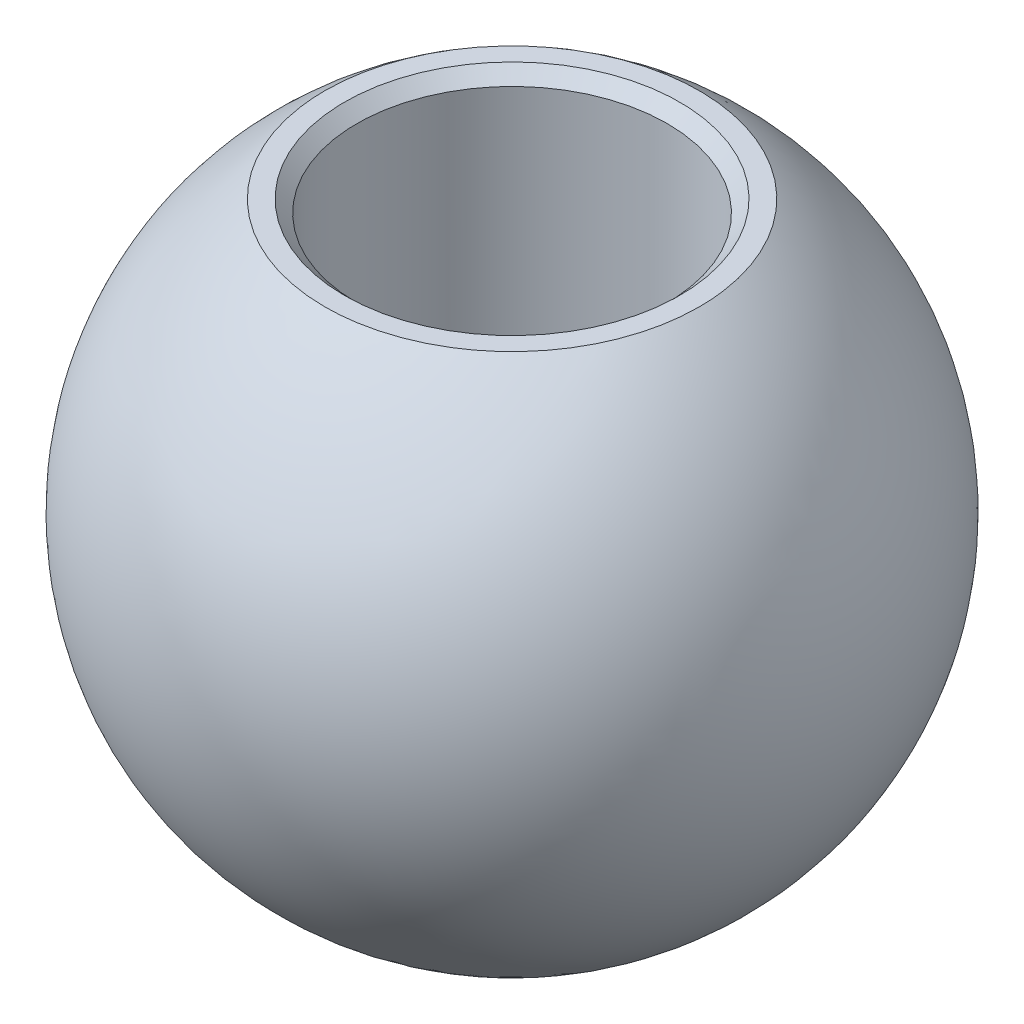
ISO-10303-21;
HEADER;
FILE_DESCRIPTION(('STEP AP214'),'2;1');
FILE_NAME('part.step','',(''),(''),'','','');
FILE_SCHEMA(('AUTOMOTIVE_DESIGN { 1 0 10303 214 1 1 1 1 }'));
ENDSEC;
DATA;
#1=APPLICATION_CONTEXT('core data for automotive mechanical design processes');
#2=APPLICATION_PROTOCOL_DEFINITION('international standard','automotive_design',2000,#1);
#3=PRODUCT_CONTEXT('',#1,'mechanical');
#4=PRODUCT('Part','Part','',(#3));
#5=PRODUCT_RELATED_PRODUCT_CATEGORY('part','',(#4));
#6=PRODUCT_DEFINITION_FORMATION('','',#4);
#7=PRODUCT_DEFINITION_CONTEXT('part definition',#1,'design');
#8=PRODUCT_DEFINITION('design','',#6,#7);
#9=PRODUCT_DEFINITION_SHAPE('','',#8);
#10=(LENGTH_UNIT() NAMED_UNIT(*) SI_UNIT(.MILLI.,.METRE.));
#11=(NAMED_UNIT(*) PLANE_ANGLE_UNIT() SI_UNIT($,.RADIAN.));
#12=(NAMED_UNIT(*) SI_UNIT($,.STERADIAN.) SOLID_ANGLE_UNIT());
#13=UNCERTAINTY_MEASURE_WITH_UNIT(LENGTH_MEASURE(1.E-05),#10,'distance_accuracy_value','');
#14=(GEOMETRIC_REPRESENTATION_CONTEXT(3) GLOBAL_UNCERTAINTY_ASSIGNED_CONTEXT((#13)) GLOBAL_UNIT_ASSIGNED_CONTEXT((#10,
#11,#12)) REPRESENTATION_CONTEXT('',''));
#15=CARTESIAN_POINT('',(0.,0.,0.));
#16=DIRECTION('',(0.,0.,1.));
#17=DIRECTION('',(1.,0.,0.));
#18=AXIS2_PLACEMENT_3D('',#15,#16,#17);
#19=CARTESIAN_POINT('',(0.,0.,39.6748));
#20=DIRECTION('',(0.,1.,0.));
#21=DIRECTION('',(0.,0.,1.));
#22=AXIS2_PLACEMENT_3D('',#19,#20,#21);
#23=CYLINDRICAL_SURFACE('',#22,3.175);
#24=CARTESIAN_POINT('',(0.,-5.29590000002145,39.6748));
#25=DIRECTION('',(0.,-1.,0.));
#26=DIRECTION('',(0.,0.,-1.));
#27=AXIS2_PLACEMENT_3D('',#24,#25,#26);
#28=CIRCLE('',#27,3.17499999999858);
#29=CARTESIAN_POINT('',(0.,-5.29590000002145,36.4998000000014));
#30=VERTEX_POINT('',#29);
#31=EDGE_CURVE('E56',#30,#30,#28,.T.);
#32=ORIENTED_EDGE('',*,*,#31,.T.);
#33=EDGE_LOOP('',(#32));
#34=FACE_BOUND('',#33,.T.);
#35=CARTESIAN_POINT('',(0.,5.29590000002145,39.6748));
#36=DIRECTION('',(0.,1.,0.));
#37=DIRECTION('',(0.,0.,-1.));
#38=AXIS2_PLACEMENT_3D('',#35,#36,#37);
#39=CIRCLE('',#38,3.17499999999858);
#40=CARTESIAN_POINT('',(0.,5.29590000002145,36.4998000000014));
#41=VERTEX_POINT('',#40);
#42=EDGE_CURVE('E53',#41,#41,#39,.T.);
#43=ORIENTED_EDGE('',*,*,#42,.T.);
#44=EDGE_LOOP('',(#43));
#45=FACE_BOUND('',#44,.T.);
#46=ADVANCED_FACE('F16',(#34,#45),#23,.F.);
#47=CARTESIAN_POINT('',(0.,-5.54990000000544,39.6748));
#48=DIRECTION('',(0.,-1.,0.));
#49=DIRECTION('',(1.,0.,0.));
#50=AXIS2_PLACEMENT_3D('',#47,#48,#49);
#51=CONICAL_SURFACE('',#50,3.42899999998257,0.785398163397448);
#52=ORIENTED_EDGE('',*,*,#31,.F.);
#53=EDGE_LOOP('',(#52));
#54=FACE_BOUND('',#53,.T.);
#55=CARTESIAN_POINT('',(0.,-5.54990000000544,39.6748));
#56=DIRECTION('',(0.,-1.,0.));
#57=DIRECTION('',(1.,0.,0.));
#58=AXIS2_PLACEMENT_3D('',#55,#56,#57);
#59=CIRCLE('',#58,3.42899999998257);
#60=CARTESIAN_POINT('',(3.42899999998257,-5.54990000000544,39.6748));
#61=VERTEX_POINT('',#60);
#62=EDGE_CURVE('E19',#61,#61,#59,.T.);
#63=ORIENTED_EDGE('',*,*,#62,.T.);
#64=EDGE_LOOP('',(#63));
#65=FACE_BOUND('',#64,.T.);
#66=ADVANCED_FACE('F72',(#54,#65),#51,.F.);
#67=CARTESIAN_POINT('',(0.,5.54990000000544,39.6748));
#68=DIRECTION('',(0.,1.,0.));
#69=DIRECTION('',(0.,0.,1.));
#70=AXIS2_PLACEMENT_3D('',#67,#68,#69);
#71=CONICAL_SURFACE('',#70,3.42899999998257,0.785398163397448);
#72=ORIENTED_EDGE('',*,*,#42,.F.);
#73=EDGE_LOOP('',(#72));
#74=FACE_BOUND('',#73,.T.);
#75=CARTESIAN_POINT('',(0.,5.54990000000544,39.6748));
#76=DIRECTION('',(0.,1.,0.));
#77=DIRECTION('',(0.,0.,1.));
#78=AXIS2_PLACEMENT_3D('',#75,#76,#77);
#79=CIRCLE('',#78,3.42899999998257);
#80=CARTESIAN_POINT('',(0.,5.54990000000544,43.1037999999826));
#81=VERTEX_POINT('',#80);
#82=EDGE_CURVE('E65',#81,#81,#79,.T.);
#83=ORIENTED_EDGE('',*,*,#82,.T.);
#84=EDGE_LOOP('',(#83));
#85=FACE_BOUND('',#84,.T.);
#86=ADVANCED_FACE('F69',(#74,#85),#71,.F.);
#87=CARTESIAN_POINT('',(0.,-5.5499,39.6748));
#88=DIRECTION('',(0.,1.,0.));
#89=DIRECTION('',(-1.,0.,0.));
#90=AXIS2_PLACEMENT_3D('',#87,#88,#89);
#91=PLANE('',#90);
#92=CARTESIAN_POINT('',(0.,-5.5499,35.8438602092959));
#93=CARTESIAN_POINT('',(-0.107560775489727,-5.5499,35.8438608538725));
#94=CARTESIAN_POINT('',(-0.215141318177451,-5.5499,35.848394213229));
#95=CARTESIAN_POINT('',(-0.429558956188675,-5.5499,35.8664981774296));
#96=CARTESIAN_POINT('',(-0.536395822611043,-5.5499,35.8800714503515));
#97=CARTESIAN_POINT('',(-0.748726176787743,-5.5499,35.9161941750471));
#98=CARTESIAN_POINT('',(-0.85421725643116,-5.5499,35.938757875481));
#99=CARTESIAN_POINT('',(-1.06298226396203,-5.5499,35.9927059197735));
#100=CARTESIAN_POINT('',(-1.16625431910558,-5.5499,36.0240974216413));
#101=CARTESIAN_POINT('',(-1.47119352235872,-5.5499,36.1310796247804));
#102=CARTESIAN_POINT('',(-1.66849689521164,-5.5499,36.2195658970729));
#103=CARTESIAN_POINT('',(-2.04542564653015,-5.5499,36.4284538360004));
#104=CARTESIAN_POINT('',(-2.2250503526241,-5.5499,36.5488567158751));
#105=CARTESIAN_POINT('',(-2.47732579567173,-5.5499,36.7506573832832));
#106=CARTESIAN_POINT('',(-2.55860486336777,-5.5499,36.8215102760885));
#107=CARTESIAN_POINT('',(-2.71484927091412,-5.5499,36.9697554186121));
#108=CARTESIAN_POINT('',(-2.7898206225931,-5.5499,37.0471412975415));
#109=CARTESIAN_POINT('',(-2.93301042319193,-5.5499,37.2079907672465));
#110=CARTESIAN_POINT('',(-3.00122579771925,-5.5499,37.2914570952949));
#111=CARTESIAN_POINT('',(-3.13038953090659,-5.5499,37.4638320543184));
#112=CARTESIAN_POINT('',(-3.1913362027842,-5.5499,37.552741941315));
#113=CARTESIAN_POINT('',(-3.36255226726154,-5.5499,37.8266674734093));
#114=CARTESIAN_POINT('',(-3.4613487532267,-5.5499,38.0190489765092));
#115=CARTESIAN_POINT('',(-3.62518118970368,-5.5499,38.4175642252858));
#116=CARTESIAN_POINT('',(-3.69021750078995,-5.5499,38.6236978240571));
#117=CARTESIAN_POINT('',(-3.7847775931866,-5.5499,39.0439845011588));
#118=CARTESIAN_POINT('',(-3.81430118484399,-5.5499,39.2581376223106));
#119=CARTESIAN_POINT('',(-3.83696718467793,-5.5499,39.6883605821669));
#120=CARTESIAN_POINT('',(-3.83010959285449,-5.5499,39.9044304208714));
#121=CARTESIAN_POINT('',(-3.7802354247317,-5.5499,40.332326517345));
#122=CARTESIAN_POINT('',(-3.73721904153498,-5.5499,40.5441527977703));
#123=CARTESIAN_POINT('',(-3.61616833900696,-5.5499,40.9576769181876));
#124=CARTESIAN_POINT('',(-3.53813364566095,-5.5499,41.1593746499757));
#125=CARTESIAN_POINT('',(-3.39664868094415,-5.5499,41.449774620064));
#126=CARTESIAN_POINT('',(-3.34538178526097,-5.5499,41.5445964014526));
#127=CARTESIAN_POINT('',(-3.23504572803441,-5.5499,41.7295892417058));
#128=CARTESIAN_POINT('',(-3.17597837591451,-5.5499,41.8197613723967));
#129=CARTESIAN_POINT('',(-3.05048283485182,-5.5499,41.994766343964));
#130=CARTESIAN_POINT('',(-2.98405799090635,-5.5499,42.0796015839123));
#131=CARTESIAN_POINT('',(-2.84425568754826,-5.5499,42.2434437431605));
#132=CARTESIAN_POINT('',(-2.77087158016473,-5.5499,42.3224449586444));
#133=CARTESIAN_POINT('',(-2.54119731222613,-5.5499,42.5496368140841));
#134=CARTESIAN_POINT('',(-2.3752185610369,-5.5499,42.6882475736777));
#135=CARTESIAN_POINT('',(-2.02232576297841,-5.5499,42.9355856574383));
#136=CARTESIAN_POINT('',(-1.83541251224212,-5.5499,43.0443141174777));
#137=CARTESIAN_POINT('',(-1.54340278936909,-5.5499,43.1827461629613));
#138=CARTESIAN_POINT('',(-1.44400096249503,-5.5499,43.2248153984807));
#139=CARTESIAN_POINT('',(-1.24206035546256,-5.5499,43.3004011847352));
#140=CARTESIAN_POINT('',(-1.1395241898226,-5.5499,43.3339246570711));
#141=CARTESIAN_POINT('',(-0.932164943094055,-5.5499,43.3921584388512));
#142=CARTESIAN_POINT('',(-0.827345753991275,-5.5499,43.4168826650393));
#143=CARTESIAN_POINT('',(-0.616017421776668,-5.5499,43.4574167619637));
#144=CARTESIAN_POINT('',(-0.509508786652331,-5.5499,43.4732292619556));
#145=CARTESIAN_POINT('',(-0.33569589332086,-5.5499,43.4915957156125));
#146=CARTESIAN_POINT('',(-0.268669921850563,-5.5499,43.4968980652815));
#147=CARTESIAN_POINT('',(-0.134431873671906,-5.5499,43.5039703042404));
#148=CARTESIAN_POINT('',(-0.0672197969635453,-5.5499,43.5057401935304));
#149=CARTESIAN_POINT('',(0.107560775489725,-5.5499,43.5057391461275));
#150=CARTESIAN_POINT('',(0.215141318177449,-5.5499,43.5012057867709));
#151=CARTESIAN_POINT('',(0.429558956188673,-5.5499,43.4831018225704));
#152=CARTESIAN_POINT('',(0.536395822611042,-5.5499,43.4695285496485));
#153=CARTESIAN_POINT('',(0.748726176787744,-5.5499,43.4334058249529));
#154=CARTESIAN_POINT('',(0.854217256431162,-5.5499,43.410842124519));
#155=CARTESIAN_POINT('',(1.06298226396203,-5.5499,43.3568940802265));
#156=CARTESIAN_POINT('',(1.16625431910558,-5.5499,43.3255025783587));
#157=CARTESIAN_POINT('',(1.47119352235872,-5.5499,43.2185203752196));
#158=CARTESIAN_POINT('',(1.66849689521164,-5.5499,43.1300341029271));
#159=CARTESIAN_POINT('',(2.04542564653015,-5.5499,42.9211461639996));
#160=CARTESIAN_POINT('',(2.22505035262411,-5.5499,42.8007432841249));
#161=CARTESIAN_POINT('',(2.47732579567173,-5.5499,42.5989426167167));
#162=CARTESIAN_POINT('',(2.55860486336778,-5.5499,42.5280897239115));
#163=CARTESIAN_POINT('',(2.71484927091412,-5.5499,42.3798445813879));
#164=CARTESIAN_POINT('',(2.7898206225931,-5.5499,42.3024587024585));
#165=CARTESIAN_POINT('',(2.93301042319193,-5.5499,42.1416092327535));
#166=CARTESIAN_POINT('',(3.00122579771925,-5.5499,42.0581429047051));
#167=CARTESIAN_POINT('',(3.1303895309066,-5.5499,41.8857679456816));
#168=CARTESIAN_POINT('',(3.1913362027842,-5.5499,41.796858058685));
#169=CARTESIAN_POINT('',(3.36255226726154,-5.5499,41.5229325265907));
#170=CARTESIAN_POINT('',(3.46134875322669,-5.5499,41.3305510234908));
#171=CARTESIAN_POINT('',(3.62518118970367,-5.5499,40.9320357747142));
#172=CARTESIAN_POINT('',(3.69021750078994,-5.5499,40.7259021759429));
#173=CARTESIAN_POINT('',(3.7847775931866,-5.5499,40.3056154988412));
#174=CARTESIAN_POINT('',(3.81430118484399,-5.5499,40.0914623776894));
#175=CARTESIAN_POINT('',(3.83696718467793,-5.5499,39.6612394178331));
#176=CARTESIAN_POINT('',(3.83010959285449,-5.5499,39.4451695791286));
#177=CARTESIAN_POINT('',(3.78023542473169,-5.5499,39.017273482655));
#178=CARTESIAN_POINT('',(3.73721904153498,-5.5499,38.8054472022297));
#179=CARTESIAN_POINT('',(3.61616833900696,-5.5499,38.3919230818124));
#180=CARTESIAN_POINT('',(3.53813364566095,-5.5499,38.1902253500243));
#181=CARTESIAN_POINT('',(3.39664868094415,-5.5499,37.899825379936));
#182=CARTESIAN_POINT('',(3.34538178526097,-5.5499,37.8050035985474));
#183=CARTESIAN_POINT('',(3.23504572803441,-5.5499,37.6200107582942));
#184=CARTESIAN_POINT('',(3.1759783759145,-5.5499,37.5298386276033));
#185=CARTESIAN_POINT('',(3.05048283485182,-5.5499,37.354833656036));
#186=CARTESIAN_POINT('',(2.98405799090635,-5.5499,37.2699984160877));
#187=CARTESIAN_POINT('',(2.84425568754825,-5.5499,37.1061562568395));
#188=CARTESIAN_POINT('',(2.77087158016472,-5.5499,37.0271550413556));
#189=CARTESIAN_POINT('',(2.54119731222612,-5.54990000000001,36.7999631859159));
#190=CARTESIAN_POINT('',(2.3752185610369,-5.5499,36.6613524263223));
#191=CARTESIAN_POINT('',(2.02232576297841,-5.5499,36.4140143425617));
#192=CARTESIAN_POINT('',(1.83541251224212,-5.5499,36.3052858825223));
#193=CARTESIAN_POINT('',(1.54340278936908,-5.5499,36.1668538370387));
#194=CARTESIAN_POINT('',(1.44400096249502,-5.5499,36.1247846015193));
#195=CARTESIAN_POINT('',(1.24206035546255,-5.5499,36.0491988152648));
#196=CARTESIAN_POINT('',(1.13952418982259,-5.5499,36.0156753429288));
#197=CARTESIAN_POINT('',(0.93216494309405,-5.5499,35.9574415611488));
#198=CARTESIAN_POINT('',(0.827345753991269,-5.5499,35.9327173349607));
#199=CARTESIAN_POINT('',(0.61601742177666,-5.5499,35.8921832380363));
#200=CARTESIAN_POINT('',(0.509508786652322,-5.5499,35.8763707380444));
#201=CARTESIAN_POINT('',(0.335695893320851,-5.5499,35.8580042843875));
#202=CARTESIAN_POINT('',(0.268669921850556,-5.5499,35.8527019347185));
#203=CARTESIAN_POINT('',(0.134431873671901,-5.5499,35.8456296957596));
#204=CARTESIAN_POINT('',(0.0672197969635419,-5.5499,35.8438598064696));
#205=CARTESIAN_POINT('',(0.,-5.5499,35.8438602092959));
#206=B_SPLINE_CURVE_WITH_KNOTS('',3,(#92,#93,#94,#95,#96,#97,#98,#99,#100,#101,#102,#103,#104,
#105,#106,#107,#108,#109,#110,#111,#112,#113,#114,#115,#116,#117,#118,#119,#120,#121,#122,#123,
#124,#125,#126,#127,#128,#129,#130,#131,#132,#133,#134,#135,#136,#137,#138,#139,#140,#141,#142,
#143,#144,#145,#146,#147,#148,#149,#150,#151,#152,#153,#154,#155,#156,#157,#158,#159,#160,#161,
#162,#163,#164,#165,#166,#167,#168,#169,#170,#171,#172,#173,#174,#175,#176,#177,#178,#179,#180,
#181,#182,#183,#184,#185,#186,#187,#188,#189,#190,#191,#192,#193,#194,#195,#196,#197,#198,#199,
#200,#201,#202,#203,#204,#205),.UNSPECIFIED.,.T.,.F.,(4,2,2,2,2,2,2,2,2,2,2,2,2,2,2,2,2,2,2,2,2,
2,2,2,2,2,2,2,2,2,2,2,2,2,2,2,2,2,2,2,2,2,2,2,2,2,2,2,2,2,2,2,2,2,2,2,4),(0.,0.322620444275019,
0.645336150321902,0.968565366326345,1.2920574317132,1.93749951402941,2.58296613492566,
2.90612234657753,3.22896698696904,3.55195787327534,3.875023567925,4.52048136649842,
5.16593227113899,5.81138662274605,6.45684097435311,7.10229187899368,7.7477496775671,
8.07081537221677,8.39380625852307,8.71665089891457,9.03980711056644,9.68527373146269,
10.3307158137789,10.6542078791657,10.9774370951702,11.3001528012171,11.6227732454921,
11.8243939632836,12.0260146810752,12.3486351253502,12.6713508313971,12.9945800474016,
13.3180721127884,13.9635141951046,14.6089808160009,14.9321370276527,15.2549816680442,
15.5779725543505,15.9010382490002,16.5464960475736,17.1919469522142,17.8374013038213,
18.4828556554283,19.1283065600689,19.7737643586423,20.096830053292,20.4198209395983,
20.7426655799898,21.0658217916416,21.7112884125379,22.3567304948541,22.680222560241,
23.0034517762454,23.3261674822923,23.6487879265673,23.8504086443589,24.0520293621504),.UNSPECIFIED.);
#207=CARTESIAN_POINT('',(0.,-5.5499,35.8438602092959));
#208=VERTEX_POINT('',#207);
#209=EDGE_CURVE('E25',#208,#208,#206,.T.);
#210=ORIENTED_EDGE('',*,*,#209,.F.);
#211=EDGE_LOOP('',(#210));
#212=FACE_BOUND('',#211,.T.);
#213=ORIENTED_EDGE('',*,*,#62,.F.);
#214=EDGE_LOOP('',(#213));
#215=FACE_BOUND('',#214,.T.);
#216=ADVANCED_FACE('F41',(#212,#215),#91,.F.);
#217=CARTESIAN_POINT('',(0.,5.5499,39.6748));
#218=DIRECTION('',(0.,-1.,0.));
#219=DIRECTION('',(0.,0.,-1.));
#220=AXIS2_PLACEMENT_3D('',#217,#218,#219);
#221=PLANE('',#220);
#222=CARTESIAN_POINT('',(0.,5.5499,43.5057397907041));
#223=CARTESIAN_POINT('',(-0.107560775489725,5.5499,43.5057391461275));
#224=CARTESIAN_POINT('',(-0.215141318177449,5.5499,43.5012057867709));
#225=CARTESIAN_POINT('',(-0.429558956188672,5.5499,43.4831018225704));
#226=CARTESIAN_POINT('',(-0.53639582261104,5.5499,43.4695285496485));
#227=CARTESIAN_POINT('',(-0.748726176787741,5.5499,43.4334058249529));
#228=CARTESIAN_POINT('',(-0.854217256431158,5.5499,43.410842124519));
#229=CARTESIAN_POINT('',(-1.06298226396203,5.5499,43.3568940802265));
#230=CARTESIAN_POINT('',(-1.16625431910558,5.5499,43.3255025783587));
#231=CARTESIAN_POINT('',(-1.47119352235872,5.5499,43.2185203752196));
#232=CARTESIAN_POINT('',(-1.66849689521164,5.5499,43.1300341029271));
#233=CARTESIAN_POINT('',(-2.04542564653015,5.5499,42.9211461639996));
#234=CARTESIAN_POINT('',(-2.2250503526241,5.5499,42.8007432841249));
#235=CARTESIAN_POINT('',(-2.47732579567172,5.5499,42.5989426167167));
#236=CARTESIAN_POINT('',(-2.55860486336777,5.5499,42.5280897239115));
#237=CARTESIAN_POINT('',(-2.71484927091412,5.5499,42.3798445813879));
#238=CARTESIAN_POINT('',(-2.78982062259309,5.5499,42.3024587024585));
#239=CARTESIAN_POINT('',(-2.93301042319193,5.5499,42.1416092327535));
#240=CARTESIAN_POINT('',(-3.00122579771925,5.5499,42.0581429047051));
#241=CARTESIAN_POINT('',(-3.13038953090659,5.5499,41.8857679456816));
#242=CARTESIAN_POINT('',(-3.1913362027842,5.5499,41.796858058685));
#243=CARTESIAN_POINT('',(-3.36255226726154,5.5499,41.5229325265907));
#244=CARTESIAN_POINT('',(-3.4613487532267,5.5499,41.3305510234908));
#245=CARTESIAN_POINT('',(-3.62518118970367,5.5499,40.9320357747142));
#246=CARTESIAN_POINT('',(-3.69021750078994,5.5499,40.7259021759429));
#247=CARTESIAN_POINT('',(-3.78477759318659,5.5499,40.3056154988412));
#248=CARTESIAN_POINT('',(-3.81430118484398,5.5499,40.0914623776894));
#249=CARTESIAN_POINT('',(-3.83696718467793,5.5499,39.6612394178331));
#250=CARTESIAN_POINT('',(-3.83010959285448,5.5499,39.4451695791286));
#251=CARTESIAN_POINT('',(-3.78023542473169,5.5499,39.017273482655));
#252=CARTESIAN_POINT('',(-3.73721904153498,5.5499,38.8054472022297));
#253=CARTESIAN_POINT('',(-3.61616833900696,5.5499,38.3919230818124));
#254=CARTESIAN_POINT('',(-3.53813364566095,5.54990000000001,38.1902253500243));
#255=CARTESIAN_POINT('',(-3.39664868094415,5.5499,37.899825379936));
#256=CARTESIAN_POINT('',(-3.34538178526096,5.5499,37.8050035985474));
#257=CARTESIAN_POINT('',(-3.2350457280344,5.5499,37.6200107582942));
#258=CARTESIAN_POINT('',(-3.1759783759145,5.5499,37.5298386276033));
#259=CARTESIAN_POINT('',(-3.05048283485182,5.5499,37.354833656036));
#260=CARTESIAN_POINT('',(-2.98405799090635,5.5499,37.2699984160877));
#261=CARTESIAN_POINT('',(-2.84425568754826,5.5499,37.1061562568395));
#262=CARTESIAN_POINT('',(-2.77087158016472,5.5499,37.0271550413556));
#263=CARTESIAN_POINT('',(-2.54119731222612,5.5499,36.7999631859159));
#264=CARTESIAN_POINT('',(-2.3752185610369,5.5499,36.6613524263223));
#265=CARTESIAN_POINT('',(-2.0223257629784,5.5499,36.4140143425617));
#266=CARTESIAN_POINT('',(-1.83541251224212,5.5499,36.3052858825223));
#267=CARTESIAN_POINT('',(-1.54340278936908,5.5499,36.1668538370387));
#268=CARTESIAN_POINT('',(-1.44400096249502,5.5499,36.1247846015193));
#269=CARTESIAN_POINT('',(-1.24206035546256,5.5499,36.0491988152648));
#270=CARTESIAN_POINT('',(-1.13952418982259,5.5499,36.0156753429289));
#271=CARTESIAN_POINT('',(-0.93216494309405,5.5499,35.9574415611488));
#272=CARTESIAN_POINT('',(-0.827345753991271,5.5499,35.9327173349607));
#273=CARTESIAN_POINT('',(-0.616017421776663,5.5499,35.8921832380363));
#274=CARTESIAN_POINT('',(-0.509508786652326,5.5499,35.8763707380444));
#275=CARTESIAN_POINT('',(-0.335695893320855,5.5499,35.8580042843875));
#276=CARTESIAN_POINT('',(-0.268669921850559,5.5499,35.8527019347185));
#277=CARTESIAN_POINT('',(-0.134431873671903,5.5499,35.8456296957596));
#278=CARTESIAN_POINT('',(-0.0672197969635432,5.5499,35.8438598064696));
#279=CARTESIAN_POINT('',(0.107560775489727,5.5499,35.8438608538725));
#280=CARTESIAN_POINT('',(0.215141318177452,5.5499,35.848394213229));
#281=CARTESIAN_POINT('',(0.429558956188675,5.5499,35.8664981774296));
#282=CARTESIAN_POINT('',(0.536395822611043,5.5499,35.8800714503515));
#283=CARTESIAN_POINT('',(0.748726176787743,5.5499,35.9161941750471));
#284=CARTESIAN_POINT('',(0.85421725643116,5.5499,35.938757875481));
#285=CARTESIAN_POINT('',(1.06298226396203,5.5499,35.9927059197735));
#286=CARTESIAN_POINT('',(1.16625431910558,5.5499,36.0240974216413));
#287=CARTESIAN_POINT('',(1.47119352235872,5.54990000000001,36.1310796247804));
#288=CARTESIAN_POINT('',(1.66849689521165,5.5499,36.2195658970729));
#289=CARTESIAN_POINT('',(2.04542564653015,5.5499,36.4284538360004));
#290=CARTESIAN_POINT('',(2.2250503526241,5.5499,36.5488567158751));
#291=CARTESIAN_POINT('',(2.47732579567173,5.5499,36.7506573832832));
#292=CARTESIAN_POINT('',(2.55860486336778,5.5499,36.8215102760885));
#293=CARTESIAN_POINT('',(2.71484927091413,5.5499,36.9697554186121));
#294=CARTESIAN_POINT('',(2.78982062259309,5.5499,37.0471412975415));
#295=CARTESIAN_POINT('',(2.93301042319193,5.5499,37.2079907672465));
#296=CARTESIAN_POINT('',(3.00122579771925,5.5499,37.2914570952949));
#297=CARTESIAN_POINT('',(3.1303895309066,5.5499,37.4638320543184));
#298=CARTESIAN_POINT('',(3.1913362027842,5.5499,37.552741941315));
#299=CARTESIAN_POINT('',(3.36255226726154,5.5499,37.8266674734093));
#300=CARTESIAN_POINT('',(3.4613487532267,5.5499,38.0190489765092));
#301=CARTESIAN_POINT('',(3.62518118970367,5.5499,38.4175642252858));
#302=CARTESIAN_POINT('',(3.69021750078994,5.5499,38.6236978240571));
#303=CARTESIAN_POINT('',(3.78477759318659,5.5499,39.0439845011588));
#304=CARTESIAN_POINT('',(3.81430118484398,5.5499,39.2581376223106));
#305=CARTESIAN_POINT('',(3.83696718467793,5.5499,39.6883605821669));
#306=CARTESIAN_POINT('',(3.83010959285449,5.5499,39.9044304208714));
#307=CARTESIAN_POINT('',(3.78023542473169,5.5499,40.332326517345));
#308=CARTESIAN_POINT('',(3.73721904153497,5.5499,40.5441527977703));
#309=CARTESIAN_POINT('',(3.61616833900696,5.5499,40.9576769181876));
#310=CARTESIAN_POINT('',(3.53813364566095,5.5499,41.1593746499757));
#311=CARTESIAN_POINT('',(3.39664868094415,5.5499,41.449774620064));
#312=CARTESIAN_POINT('',(3.34538178526096,5.5499,41.5445964014526));
#313=CARTESIAN_POINT('',(3.2350457280344,5.5499,41.7295892417058));
#314=CARTESIAN_POINT('',(3.1759783759145,5.5499,41.8197613723966));
#315=CARTESIAN_POINT('',(3.05048283485182,5.5499,41.994766343964));
#316=CARTESIAN_POINT('',(2.98405799090636,5.5499,42.0796015839123));
#317=CARTESIAN_POINT('',(2.84425568754826,5.5499,42.2434437431605));
#318=CARTESIAN_POINT('',(2.77087158016473,5.5499,42.3224449586444));
#319=CARTESIAN_POINT('',(2.54119731222612,5.54989999999999,42.5496368140841));
#320=CARTESIAN_POINT('',(2.37521856103691,5.5499,42.6882475736777));
#321=CARTESIAN_POINT('',(2.02232576297841,5.5499,42.9355856574383));
#322=CARTESIAN_POINT('',(1.83541251224212,5.5499,43.0443141174777));
#323=CARTESIAN_POINT('',(1.54340278936908,5.5499,43.1827461629613));
#324=CARTESIAN_POINT('',(1.44400096249503,5.5499,43.2248153984807));
#325=CARTESIAN_POINT('',(1.24206035546256,5.5499,43.3004011847352));
#326=CARTESIAN_POINT('',(1.1395241898226,5.5499,43.3339246570711));
#327=CARTESIAN_POINT('',(0.932164943094052,5.5499,43.3921584388512));
#328=CARTESIAN_POINT('',(0.827345753991272,5.5499,43.4168826650393));
#329=CARTESIAN_POINT('',(0.616017421776664,5.5499,43.4574167619637));
#330=CARTESIAN_POINT('',(0.509508786652326,5.5499,43.4732292619556));
#331=CARTESIAN_POINT('',(0.335695893320855,5.5499,43.4915957156125));
#332=CARTESIAN_POINT('',(0.268669921850559,5.5499,43.4968980652815));
#333=CARTESIAN_POINT('',(0.134431873671904,5.5499,43.5039703042404));
#334=CARTESIAN_POINT('',(0.0672197969635439,5.5499,43.5057401935304));
#335=CARTESIAN_POINT('',(0.,5.5499,43.5057397907041));
#336=B_SPLINE_CURVE_WITH_KNOTS('',3,(#222,#223,#224,#225,#226,#227,#228,#229,#230,#231,#232,
#233,#234,#235,#236,#237,#238,#239,#240,#241,#242,#243,#244,#245,#246,#247,#248,#249,#250,#251,
#252,#253,#254,#255,#256,#257,#258,#259,#260,#261,#262,#263,#264,#265,#266,#267,#268,#269,#270,
#271,#272,#273,#274,#275,#276,#277,#278,#279,#280,#281,#282,#283,#284,#285,#286,#287,#288,#289,
#290,#291,#292,#293,#294,#295,#296,#297,#298,#299,#300,#301,#302,#303,#304,#305,#306,#307,#308,
#309,#310,#311,#312,#313,#314,#315,#316,#317,#318,#319,#320,#321,#322,#323,#324,#325,#326,#327,
#328,#329,#330,#331,#332,#333,#334,#335),.UNSPECIFIED.,.T.,.F.,(4,2,2,2,2,2,2,2,2,2,2,2,2,2,2,2,
2,2,2,2,2,2,2,2,2,2,2,2,2,2,2,2,2,2,2,2,2,2,2,2,2,2,2,2,2,2,2,2,2,2,2,2,2,2,2,2,4),(0.,
0.322620444275018,0.6453361503219,0.968565366326346,1.2920574317132,1.93749951402941,
2.58296613492566,2.90612234657752,3.22896698696903,3.55195787327533,3.87502356792499,
4.52048136649841,5.16593227113898,5.81138662274604,6.4568409743531,7.10229187899367,
7.7477496775671,8.07081537221676,8.39380625852306,8.71665089891457,9.03980711056643,
9.68527373146268,10.3307158137789,10.6542078791657,10.9774370951702,11.3001528012171,
11.6227732454921,11.8243939632836,12.0260146810752,12.3486351253502,12.6713508313971,
12.9945800474015,13.3180721127884,13.9635141951046,14.6089808160009,14.9321370276527,
15.2549816680442,15.5779725543505,15.9010382490002,16.5464960475736,17.1919469522142,
17.8374013038213,18.4828556554283,19.1283065600689,19.7737643586423,20.096830053292,
20.4198209395983,20.7426655799898,21.0658217916416,21.7112884125379,22.3567304948541,
22.6802225602409,23.0034517762454,23.3261674822923,23.6487879265673,23.8504086443589,
24.0520293621504),.UNSPECIFIED.);
#337=CARTESIAN_POINT('',(0.,5.5499,43.5057397907041));
#338=VERTEX_POINT('',#337);
#339=EDGE_CURVE('E11',#338,#338,#336,.T.);
#340=ORIENTED_EDGE('',*,*,#339,.F.);
#341=EDGE_LOOP('',(#340));
#342=FACE_BOUND('',#341,.T.);
#343=ORIENTED_EDGE('',*,*,#82,.F.);
#344=EDGE_LOOP('',(#343));
#345=FACE_BOUND('',#344,.T.);
#346=ADVANCED_FACE('F33',(#342,#345),#221,.F.);
#347=CARTESIAN_POINT('',(0.,0.,39.6748));
#348=DIRECTION('',(1.,0.,0.));
#349=DIRECTION('',(0.,1.,0.));
#350=AXIS2_PLACEMENT_3D('',#347,#348,#349);
#351=SPHERICAL_SURFACE('',#350,6.7437);
#352=ORIENTED_EDGE('',*,*,#209,.T.);
#353=EDGE_LOOP('',(#352));
#354=FACE_BOUND('',#353,.T.);
#355=ORIENTED_EDGE('',*,*,#339,.T.);
#356=EDGE_LOOP('',(#355));
#357=FACE_BOUND('',#356,.T.);
#358=CARTESIAN_POINT('',(-6.7437,0.,39.6748));
#359=VERTEX_POINT('',#358);
#360=VERTEX_LOOP('',#359);
#361=FACE_BOUND('',#360,.T.);
#362=CARTESIAN_POINT('',(6.7437,0.,39.6748));
#363=VERTEX_POINT('',#362);
#364=VERTEX_LOOP('',#363);
#365=FACE_BOUND('',#364,.T.);
#366=ADVANCED_FACE('F31',(#354,#357,#361,#365),#351,.T.);
#367=CLOSED_SHELL('',(#46,#66,#86,#216,#346,#366));
#368=MANIFOLD_SOLID_BREP('B1',#367);
#369=ADVANCED_BREP_SHAPE_REPRESENTATION('',(#18,#368),#14);
#370=SHAPE_DEFINITION_REPRESENTATION(#9,#369);
ENDSEC;
END-ISO-10303-21;
